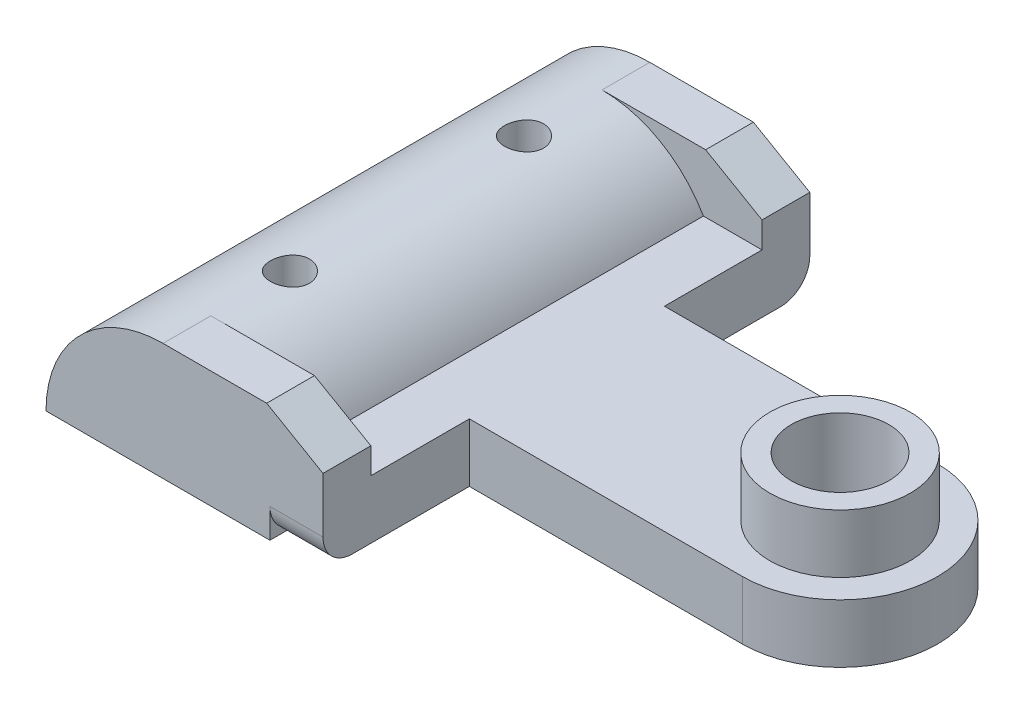
ISO-10303-21;
HEADER;
FILE_DESCRIPTION(('STEP AP214'),'2;1');
FILE_NAME('part.step','',(''),(''),'','','');
FILE_SCHEMA(('AUTOMOTIVE_DESIGN { 1 0 10303 214 1 1 1 1 }'));
ENDSEC;
DATA;
#1=APPLICATION_CONTEXT('core data for automotive mechanical design processes');
#2=APPLICATION_PROTOCOL_DEFINITION('international standard','automotive_design',2000,#1);
#3=PRODUCT_CONTEXT('',#1,'mechanical');
#4=PRODUCT('Part','Part','',(#3));
#5=PRODUCT_RELATED_PRODUCT_CATEGORY('part','',(#4));
#6=PRODUCT_DEFINITION_FORMATION('','',#4);
#7=PRODUCT_DEFINITION_CONTEXT('part definition',#1,'design');
#8=PRODUCT_DEFINITION('design','',#6,#7);
#9=PRODUCT_DEFINITION_SHAPE('','',#8);
#10=(LENGTH_UNIT() NAMED_UNIT(*) SI_UNIT(.MILLI.,.METRE.));
#11=(NAMED_UNIT(*) PLANE_ANGLE_UNIT() SI_UNIT($,.RADIAN.));
#12=(NAMED_UNIT(*) SI_UNIT($,.STERADIAN.) SOLID_ANGLE_UNIT());
#13=UNCERTAINTY_MEASURE_WITH_UNIT(LENGTH_MEASURE(1.E-05),#10,'distance_accuracy_value','');
#14=(GEOMETRIC_REPRESENTATION_CONTEXT(3) GLOBAL_UNCERTAINTY_ASSIGNED_CONTEXT((#13)) GLOBAL_UNIT_ASSIGNED_CONTEXT((#10,
#11,#12)) REPRESENTATION_CONTEXT('',''));
#15=CARTESIAN_POINT('',(0.,0.,0.));
#16=DIRECTION('',(0.,0.,1.));
#17=DIRECTION('',(1.,0.,0.));
#18=AXIS2_PLACEMENT_3D('',#15,#16,#17);
#19=CARTESIAN_POINT('',(-16.8477316832416,3.,12.1034034193238));
#20=DIRECTION('',(0.,0.,-1.));
#21=DIRECTION('',(-1.,0.,0.));
#22=AXIS2_PLACEMENT_3D('',#19,#20,#21);
#23=PLANE('',#22);
#24=CARTESIAN_POINT('',(-10.8477316832416,0.,12.1034034193238));
#25=DIRECTION('',(0.,0.,1.));
#26=DIRECTION('',(1.,0.,0.));
#27=AXIS2_PLACEMENT_3D('',#24,#25,#26);
#28=CIRCLE('',#27,6.);
#29=CARTESIAN_POINT('',(-10.8477316832416,6.,12.1034034193238));
#30=VERTEX_POINT('',#29);
#31=CARTESIAN_POINT('',(-16.8477316832416,0.,12.1034034193238));
#32=VERTEX_POINT('',#31);
#33=EDGE_CURVE('E165',#30,#32,#28,.T.);
#34=ORIENTED_EDGE('',*,*,#33,.T.);
#35=DIRECTION('',(1.,0.,0.));
#36=VECTOR('',#35,1.);
#37=CARTESIAN_POINT('',(-16.8477316832416,0.,12.1034034193238));
#38=LINE('',#37,#36);
#39=CARTESIAN_POINT('',(-5.36773092030781,0.,12.1034034193238));
#40=VERTEX_POINT('',#39);
#41=EDGE_CURVE('E169',#32,#40,#38,.T.);
#42=ORIENTED_EDGE('',*,*,#41,.T.);
#43=DIRECTION('',(0.,-1.,0.));
#44=VECTOR('',#43,1.);
#45=CARTESIAN_POINT('',(-5.36773092030781,3.,12.1034034193238));
#46=LINE('',#45,#44);
#47=CARTESIAN_POINT('',(-5.36773092030781,1.5,12.1034034193238));
#48=VERTEX_POINT('',#47);
#49=EDGE_CURVE('E399',#48,#40,#46,.T.);
#50=ORIENTED_EDGE('',*,*,#49,.F.);
#51=DIRECTION('',(1.,0.,0.));
#52=VECTOR('',#51,1.);
#53=CARTESIAN_POINT('',(-5.36773092030781,1.5,12.1034034193238));
#54=LINE('',#53,#52);
#55=CARTESIAN_POINT('',(-2.64773092030781,1.5,12.1034034193238));
#56=VERTEX_POINT('',#55);
#57=EDGE_CURVE('E409',#48,#56,#54,.T.);
#58=ORIENTED_EDGE('',*,*,#57,.T.);
#59=DIRECTION('',(0.,-1.,0.));
#60=VECTOR('',#59,1.);
#61=CARTESIAN_POINT('',(-2.64773092030781,3.,12.1034034193238));
#62=LINE('',#61,#60);
#63=CARTESIAN_POINT('',(-2.64773092030781,4.33,12.1034034193238));
#64=VERTEX_POINT('',#63);
#65=EDGE_CURVE('E241',#64,#56,#62,.T.);
#66=ORIENTED_EDGE('',*,*,#65,.F.);
#67=DIRECTION('',(0.865836232375568,-0.500327511441937,0.));
#68=VECTOR('',#67,1.);
#69=CARTESIAN_POINT('',(-5.53773092030781,6.,12.1034034193238));
#70=LINE('',#69,#68);
#71=CARTESIAN_POINT('',(-5.53773092030781,6.,12.1034034193238));
#72=VERTEX_POINT('',#71);
#73=EDGE_CURVE('E255',#72,#64,#70,.T.);
#74=ORIENTED_EDGE('',*,*,#73,.F.);
#75=DIRECTION('',(1.,0.,0.));
#76=VECTOR('',#75,1.);
#77=CARTESIAN_POINT('',(-2.64773092030781,6.,12.1034034193238));
#78=LINE('',#77,#76);
#79=EDGE_CURVE('E172',#30,#72,#78,.T.);
#80=ORIENTED_EDGE('',*,*,#79,.F.);
#81=EDGE_LOOP('',(#34,#42,#50,#58,#66,#74,#80));
#82=FACE_BOUND('',#81,.T.);
#83=ADVANCED_FACE('F39',(#82),#23,.F.);
#84=CARTESIAN_POINT('',(11.352269702831,3.,-0.396596580674838));
#85=DIRECTION('',(0.,1.,0.));
#86=DIRECTION('',(0.,0.,1.));
#87=AXIS2_PLACEMENT_3D('',#84,#85,#86);
#88=PLANE('',#87);
#89=DIRECTION('',(0.,0.,1.));
#90=VECTOR('',#89,1.);
#91=CARTESIAN_POINT('',(-5.65157926053492,3.,-23.6632502163318));
#92=LINE('',#91,#90);
#93=CARTESIAN_POINT('',(-5.65157926053492,3.,-10.3965963899398));
#94=VERTEX_POINT('',#93);
#95=CARTESIAN_POINT('',(-5.65157926053492,3.,9.6534034193238));
#96=VERTEX_POINT('',#95);
#97=EDGE_CURVE('E177',#94,#96,#92,.T.);
#98=ORIENTED_EDGE('',*,*,#97,.T.);
#99=DIRECTION('',(-1.,0.,0.));
#100=VECTOR('',#99,1.);
#101=CARTESIAN_POINT('',(-2.64773092030781,3.,9.6534034193238));
#102=LINE('',#101,#100);
#103=CARTESIAN_POINT('',(-2.64773092030781,3.,9.6534034193238));
#104=VERTEX_POINT('',#103);
#105=EDGE_CURVE('E279',#104,#96,#102,.T.);
#106=ORIENTED_EDGE('',*,*,#105,.F.);
#107=DIRECTION('',(0.,0.,-1.));
#108=VECTOR('',#107,1.);
#109=CARTESIAN_POINT('',(-2.64773092030781,3.,4.60340341932509));
#110=LINE('',#109,#108);
#111=CARTESIAN_POINT('',(-2.64773092030781,3.,4.60340341932509));
#112=VERTEX_POINT('',#111);
#113=EDGE_CURVE('E219',#104,#112,#110,.T.);
#114=ORIENTED_EDGE('',*,*,#113,.T.);
#115=DIRECTION('',(1.,0.,0.));
#116=VECTOR('',#115,1.);
#117=CARTESIAN_POINT('',(11.352269702831,3.,4.6034034193251));
#118=LINE('',#117,#116);
#119=CARTESIAN_POINT('',(11.352269702831,3.,4.6034034193251));
#120=VERTEX_POINT('',#119);
#121=EDGE_CURVE('E318',#112,#120,#118,.T.);
#122=ORIENTED_EDGE('',*,*,#121,.T.);
#123=CARTESIAN_POINT('',(11.352269702831,3.,-0.396596580674838));
#124=DIRECTION('',(0.,1.,0.));
#125=DIRECTION('',(0.,0.,1.));
#126=AXIS2_PLACEMENT_3D('',#123,#124,#125);
#127=CIRCLE('',#126,4.99999999999993);
#128=CARTESIAN_POINT('',(11.352269702831,3.,-5.39659658067477));
#129=VERTEX_POINT('',#128);
#130=EDGE_CURVE('E321',#120,#129,#127,.T.);
#131=ORIENTED_EDGE('',*,*,#130,.T.);
#132=DIRECTION('',(-1.,0.,0.));
#133=VECTOR('',#132,1.);
#134=CARTESIAN_POINT('',(11.352269702831,3.,-5.39659658067477));
#135=LINE('',#134,#133);
#136=CARTESIAN_POINT('',(-2.64773092030781,3.,-5.39659658067477));
#137=VERTEX_POINT('',#136);
#138=EDGE_CURVE('E324',#129,#137,#135,.T.);
#139=ORIENTED_EDGE('',*,*,#138,.T.);
#140=DIRECTION('',(0.,0.,-1.));
#141=VECTOR('',#140,1.);
#142=CARTESIAN_POINT('',(-2.64773092030781,3.,-12.8465963899398));
#143=LINE('',#142,#141);
#144=CARTESIAN_POINT('',(-2.64773092030781,3.,-10.3965963899398));
#145=VERTEX_POINT('',#144);
#146=EDGE_CURVE('E225',#137,#145,#143,.T.);
#147=ORIENTED_EDGE('',*,*,#146,.T.);
#148=DIRECTION('',(1.,0.,0.));
#149=VECTOR('',#148,1.);
#150=CARTESIAN_POINT('',(-2.64773092030781,3.,-10.3965963899398));
#151=LINE('',#150,#149);
#152=EDGE_CURVE('E273',#94,#145,#151,.T.);
#153=ORIENTED_EDGE('',*,*,#152,.F.);
#154=EDGE_LOOP('',(#98,#106,#114,#122,#131,#139,#147,#153));
#155=FACE_BOUND('',#154,.T.);
#156=CARTESIAN_POINT('',(11.3522690891547,3.,-0.396596520126448));
#157=DIRECTION('',(0.,1.,0.));
#158=DIRECTION('',(0.,0.,1.));
#159=AXIS2_PLACEMENT_3D('',#156,#157,#158);
#160=CIRCLE('',#159,3.6);
#161=CARTESIAN_POINT('',(11.3522690891547,3.,3.20340347987355));
#162=VERTEX_POINT('',#161);
#163=EDGE_CURVE('E422',#162,#162,#160,.T.);
#164=ORIENTED_EDGE('',*,*,#163,.F.);
#165=EDGE_LOOP('',(#164));
#166=FACE_BOUND('',#165,.T.);
#167=ADVANCED_FACE('F331',(#155,#166),#88,.T.);
#168=CARTESIAN_POINT('',(-10.8477316832416,0.,-23.6632502163318));
#169=DIRECTION('',(0.,0.,1.));
#170=DIRECTION('',(1.,0.,0.));
#171=AXIS2_PLACEMENT_3D('',#168,#169,#170);
#172=CYLINDRICAL_SURFACE('',#171,6.);
#173=CARTESIAN_POINT('',(-10.8477314940143,6.,-7.39659658067497));
#174=CARTESIAN_POINT('',(-10.9034878583811,5.9999990464337,-7.39659434509584));
#175=CARTESIAN_POINT('',(-10.9592746515408,5.99921471510292,-7.39191767050584));
#176=CARTESIAN_POINT('',(-11.06928359227,5.99616138642469,-7.37334231624371));
#177=CARTESIAN_POINT('',(-11.1235042531726,5.99389102387063,-7.35943515642365));
#178=CARTESIAN_POINT('',(-11.2287734095585,5.98812028394675,-7.32283039824837));
#179=CARTESIAN_POINT('',(-11.2798244603423,5.9846209129477,-7.30013999048727));
#180=CARTESIAN_POINT('',(-11.3773882541802,5.97677692304326,-7.2466316576828));
#181=CARTESIAN_POINT('',(-11.4239015154637,5.97243240082681,-7.21581466221271));
#182=CARTESIAN_POINT('',(-11.511520569201,5.9633332876299,-7.14661453679763));
#183=CARTESIAN_POINT('',(-11.5525766867519,5.95857550594815,-7.1081689228952));
#184=CARTESIAN_POINT('',(-11.6276869282337,5.94921052776879,-7.02493737795738));
#185=CARTESIAN_POINT('',(-11.6617406101041,5.94460334079357,-6.98015104693681));
#186=CARTESIAN_POINT('',(-11.7220783835222,5.93603028513497,-6.88516817306038));
#187=CARTESIAN_POINT('',(-11.7483133557575,5.93206853893468,-6.83494002265029));
#188=CARTESIAN_POINT('',(-11.7919548830719,5.9252791825018,-6.73071272715132));
#189=CARTESIAN_POINT('',(-11.8093620344949,5.92245149566304,-6.67671383706681));
#190=CARTESIAN_POINT('',(-11.8346972905648,5.91828217135205,-6.56700443560904));
#191=CARTESIAN_POINT('',(-11.8427111516911,5.91692709802402,-6.51131424829051));
#192=CARTESIAN_POINT('',(-11.849298230857,5.91581577987258,-6.39936442675891));
#193=CARTESIAN_POINT('',(-11.8478721170147,5.91605942189945,-6.3431048331272));
#194=CARTESIAN_POINT('',(-11.8356895799674,5.91810573926517,-6.23222538476013));
#195=CARTESIAN_POINT('',(-11.8250294929802,5.9198923168875,-6.17759460504887));
#196=CARTESIAN_POINT('',(-11.7948327951151,5.92479800391048,-6.07090799382932));
#197=CARTESIAN_POINT('',(-11.7752958797957,5.92791715901325,-6.01885225070289));
#198=CARTESIAN_POINT('',(-11.727802434273,5.93515393919809,-5.9185049837081));
#199=CARTESIAN_POINT('',(-11.699805900048,5.93927628977689,-5.87023274817706));
#200=CARTESIAN_POINT('',(-11.6362163384054,5.9480516937986,-5.77903474570732));
#201=CARTESIAN_POINT('',(-11.6006226978699,5.95270479006076,-5.73610941072866));
#202=CARTESIAN_POINT('',(-11.5223244106596,5.96208812934517,-5.65626606542812));
#203=CARTESIAN_POINT('',(-11.479537109327,5.96681861382743,-5.61942909056768));
#204=CARTESIAN_POINT('',(-11.3883456190559,5.97577042041917,-5.55344538975228));
#205=CARTESIAN_POINT('',(-11.3399413939297,5.97999173924794,-5.52429871334699));
#206=CARTESIAN_POINT('',(-11.2388138790208,5.98745558273837,-5.47451560027352));
#207=CARTESIAN_POINT('',(-11.1860870004779,5.99069728342084,-5.45388632247191));
#208=CARTESIAN_POINT('',(-11.0778508438011,5.99583001889056,-5.42179880263766));
#209=CARTESIAN_POINT('',(-11.0223417988418,5.99772116666637,-5.41033979340175));
#210=CARTESIAN_POINT('',(-10.9108154589367,5.99992452133552,-5.39702794409909));
#211=CARTESIAN_POINT('',(-10.8548117909129,6.00025501229387,-5.39506385859247));
#212=CARTESIAN_POINT('',(-10.7432755822185,5.99934989436594,-5.40050102509316));
#213=CARTESIAN_POINT('',(-10.6877430235032,5.99811434573826,-5.40790191675162));
#214=CARTESIAN_POINT('',(-10.5790690141092,5.99422729886033,-5.43176642794667));
#215=CARTESIAN_POINT('',(-10.5259151345633,5.99158440841287,-5.44817497213957));
#216=CARTESIAN_POINT('',(-10.4231127233009,5.98517784322812,-5.48953029755892));
#217=CARTESIAN_POINT('',(-10.3734643886194,5.98141410555369,-5.51447755825803));
#218=CARTESIAN_POINT('',(-10.2785991946117,5.97313804495016,-5.57245694340655));
#219=CARTESIAN_POINT('',(-10.2334253677268,5.96861940142191,-5.60555855743374));
#220=CARTESIAN_POINT('',(-10.1492340295825,5.95935384386154,-5.67881142437696));
#221=CARTESIAN_POINT('',(-10.1102169658845,5.95460691326696,-5.71896318935081));
#222=CARTESIAN_POINT('',(-10.0390343461339,5.94536067031806,-5.80567552331143));
#223=CARTESIAN_POINT('',(-10.0069439518167,5.94086443243297,-5.85229817252369));
#224=CARTESIAN_POINT('',(-9.95105052908947,5.93268608435176,-5.95033769875521));
#225=CARTESIAN_POINT('',(-9.92724723797941,5.92900394835007,-6.00175442373745));
#226=CARTESIAN_POINT('',(-9.88871611722565,5.92289377699887,-6.10771241185236));
#227=CARTESIAN_POINT('',(-9.87395087600144,5.92046057872135,-6.16223975925825));
#228=CARTESIAN_POINT('',(-9.85379726635701,5.91711082780508,-6.27304457809401));
#229=CARTESIAN_POINT('',(-9.84840808273143,5.91619414331273,-6.32932189693875));
#230=CARTESIAN_POINT('',(-9.84718230083408,5.91598689242416,-6.44127860038113));
#231=CARTESIAN_POINT('',(-9.85122739284518,5.91667618628423,-6.49695668773503));
#232=CARTESIAN_POINT('',(-9.86849951212635,5.91955908685278,-6.60682824009526));
#233=CARTESIAN_POINT('',(-9.88172650963563,5.92175268868544,-6.661021709913));
#234=CARTESIAN_POINT('',(-9.9169416532798,5.92738938836382,-6.76633992243615));
#235=CARTESIAN_POINT('',(-9.93891961353757,5.93083103310807,-6.81746815366499));
#236=CARTESIAN_POINT('',(-9.99100064979604,5.93857744224092,-6.91533082143178));
#237=CARTESIAN_POINT('',(-10.0211041287879,5.942882249436,-6.96206503989035));
#238=CARTESIAN_POINT('',(-10.0890039008163,5.95193378703998,-7.05041079305472));
#239=CARTESIAN_POINT('',(-10.1268872305216,5.95668515481279,-7.09195496854283));
#240=CARTESIAN_POINT('',(-10.2090878464892,5.96605746545558,-7.16813720750937));
#241=CARTESIAN_POINT('',(-10.2534066155648,5.97067837797299,-7.20277367497997));
#242=CARTESIAN_POINT('',(-10.3475837967921,5.97930610030225,-7.26437587831846));
#243=CARTESIAN_POINT('',(-10.3974783518953,5.98330844875507,-7.29128698842716));
#244=CARTESIAN_POINT('',(-10.5011262439666,5.99020465818984,-7.33630436945605));
#245=CARTESIAN_POINT('',(-10.5548756763356,5.99309962252339,-7.35441940929062));
#246=CARTESIAN_POINT('',(-10.6486501556404,5.99682315659141,-7.37739868844218));
#247=CARTESIAN_POINT('',(-10.6881079503483,5.99800810376942,-7.38458636734036));
#248=CARTESIAN_POINT('',(-10.7676157640569,5.9995968613589,-7.39418607557361));
#249=CARTESIAN_POINT('',(-10.8076657728495,6.00000068521902,-7.39659818712997));
#250=CARTESIAN_POINT('',(-10.8477314940143,6.,-7.39659658067497));
#251=B_SPLINE_CURVE_WITH_KNOTS('',3,(#173,#174,#175,#176,#177,#178,#179,#180,#181,#182,#183,
#184,#185,#186,#187,#188,#189,#190,#191,#192,#193,#194,#195,#196,#197,#198,#199,#200,#201,#202,
#203,#204,#205,#206,#207,#208,#209,#210,#211,#212,#213,#214,#215,#216,#217,#218,#219,#220,#221,
#222,#223,#224,#225,#226,#227,#228,#229,#230,#231,#232,#233,#234,#235,#236,#237,#238,#239,#240,
#241,#242,#243,#244,#245,#246,#247,#248,#249,#250),.UNSPECIFIED.,.T.,.F.,(4,2,2,2,2,2,2,2,2,2,2,
2,2,2,2,2,2,2,2,2,2,2,2,2,2,2,2,2,2,2,2,2,2,2,2,2,2,2,4),(0.,0.167122641115988,
0.334399032551409,0.501538768229684,0.668659393637694,0.837209999826244,1.00577124326703,
1.17537013334848,1.34495756502753,1.51298437404163,1.68099929101878,1.84728216918787,
2.01357075065858,2.18065832534667,2.34775938979574,2.51693119446551,2.68610408910605,
2.85541888538372,3.02471951496076,3.19203167788578,3.35933740311112,3.52563138663997,
3.69193470957041,3.85970747727199,4.02749243548172,4.19701548004996,4.36653315027314,
4.5353442980931,4.70414076782159,4.87083186165462,5.0375224152041,5.20401951013615,
5.37052486413315,5.53900578851508,5.70752559498964,5.87720919460256,6.04672328539223,
6.16681727828283,6.28690920348843),.UNSPECIFIED.);
#252=CARTESIAN_POINT('',(-10.8477314940143,6.,-7.39659658067497));
#253=VERTEX_POINT('',#252);
#254=EDGE_CURVE('E442',#253,#253,#251,.T.);
#255=ORIENTED_EDGE('',*,*,#254,.F.);
#256=EDGE_LOOP('',(#255));
#257=FACE_BOUND('',#256,.T.);
#258=CARTESIAN_POINT('',(-10.8477308160423,5.99999999999994,4.6034034193251));
#259=CARTESIAN_POINT('',(-10.9034871849603,5.99999905273383,4.60340565490416));
#260=CARTESIAN_POINT('',(-10.9592739827565,5.9992147275788,4.60808232981505));
#261=CARTESIAN_POINT('',(-11.0692829328047,5.99616141083237,4.62665768543437));
#262=CARTESIAN_POINT('',(-11.1235035983904,5.99389105403437,4.64056484628892));
#263=CARTESIAN_POINT('',(-11.2287727640442,5.98812032506091,4.67716960728137));
#264=CARTESIAN_POINT('',(-11.2798238194115,5.98462095925609,4.69986001682866));
#265=CARTESIAN_POINT('',(-11.3773876221148,5.97677697908934,4.75336835391635));
#266=CARTESIAN_POINT('',(-11.4239008876802,5.97243246141637,4.78418535188371));
#267=CARTESIAN_POINT('',(-11.5115199493164,5.96333335665549,4.85338548274453));
#268=CARTESIAN_POINT('',(-11.5525760705125,5.95857557886223,4.89183109956046));
#269=CARTESIAN_POINT('',(-11.6276863187911,5.94921060768682,4.97506265076197));
#270=CARTESIAN_POINT('',(-11.6617400038131,5.94460342382703,5.01984898513287));
#271=CARTESIAN_POINT('',(-11.7220777832524,5.93603037356567,5.11483186643039));
#272=CARTESIAN_POINT('',(-11.7483127582915,5.93206862964741,5.16506002095346));
#273=CARTESIAN_POINT('',(-11.7919542905284,5.92527927693459,5.26928732497848));
#274=CARTESIAN_POINT('',(-11.809361444069,5.92245159153406,5.32328621947644));
#275=CARTESIAN_POINT('',(-11.8346967038735,5.91828226919581,5.43299563083147));
#276=CARTESIAN_POINT('',(-11.8427105664731,5.91692719643369,5.48868582366738));
#277=CARTESIAN_POINT('',(-11.8492976475874,5.91581587862248,5.60063565638838));
#278=CARTESIAN_POINT('',(-11.8478715342196,5.91605952042384,5.65689525569215));
#279=CARTESIAN_POINT('',(-11.835688997042,5.91810583657768,5.76777471591701));
#280=CARTESIAN_POINT('',(-11.8250289093691,5.91989241323686,5.8224055018034));
#281=CARTESIAN_POINT('',(-11.7948322089458,5.92479809761449,5.92909212518596));
#282=CARTESIAN_POINT('',(-11.775295291754,5.927917251035,5.98114787430029));
#283=CARTESIAN_POINT('',(-11.727801841427,5.93515402711399,6.08149515265952));
#284=CARTESIAN_POINT('',(-11.6998053043048,5.93927637526103,6.12976739358447));
#285=CARTESIAN_POINT('',(-11.6362157358407,5.94805177369175,6.22096540626019));
#286=CARTESIAN_POINT('',(-11.6006220913814,5.95270486679457,6.26389074605127));
#287=CARTESIAN_POINT('',(-11.5223237959542,5.9620881989197,6.34373409963799));
#288=CARTESIAN_POINT('',(-11.479536490418,5.96681867939264,6.38057107806069));
#289=CARTESIAN_POINT('',(-11.3883449911733,5.97577047725304,6.4465547852208));
#290=CARTESIAN_POINT('',(-11.3399407612778,5.97999179135982,6.47570146440927));
#291=CARTESIAN_POINT('',(-11.2388132371092,5.98745562469925,6.52548458184614));
#292=CARTESIAN_POINT('',(-11.18608635413,5.99069731996467,6.54611386133592));
#293=CARTESIAN_POINT('',(-11.0778501884985,5.99583004407889,6.57820138385782));
#294=CARTESIAN_POINT('',(-11.0223411390209,5.99772118591631,6.58966039409332));
#295=CARTESIAN_POINT('',(-10.9108147901412,5.99992452840767,6.60297224474778));
#296=CARTESIAN_POINT('',(-10.8548111176589,6.00025501312934,6.60493633060407));
#297=CARTESIAN_POINT('',(-10.7432749002089,5.99934988253253,6.59949916423093));
#298=CARTESIAN_POINT('',(-10.6877423371965,5.99811432747253,6.59209827234955));
#299=CARTESIAN_POINT('',(-10.5790683186307,5.99422726773577,6.56823376004424));
#300=CARTESIAN_POINT('',(-10.5259144342393,5.99158437084099,6.5518252148336));
#301=CARTESIAN_POINT('',(-10.4231120135913,5.98517779292147,6.51046988670153));
#302=CARTESIAN_POINT('',(-10.3734636743702,5.98141404895948,6.4855226243066));
#303=CARTESIAN_POINT('',(-10.2785984708393,5.973137976033,6.42754323466036));
#304=CARTESIAN_POINT('',(-10.23342463905,5.96861932646143,6.39444161770243));
#305=CARTESIAN_POINT('',(-10.1492332916777,5.95935375740858,6.3211887440548));
#306=CARTESIAN_POINT('',(-10.1102162236563,5.95460682136488,6.28103697530692));
#307=CARTESIAN_POINT('',(-10.0390335958437,5.94536056829096,6.19432463287911));
#308=CARTESIAN_POINT('',(-10.0069431978093,5.94086432573926,6.14770197895358));
#309=CARTESIAN_POINT('',(-9.95104976854576,5.93268596941955,6.04966244256571));
#310=CARTESIAN_POINT('',(-9.92724647461572,5.92900382984587,5.99824571214087));
#311=CARTESIAN_POINT('',(-9.88871534959159,5.92289365271397,5.89228771343161));
#312=CARTESIAN_POINT('',(-9.87395010677324,5.9204604522031,5.83776036092813));
#313=CARTESIAN_POINT('',(-9.8537964948231,5.9171106982081,5.72695553162473));
#314=CARTESIAN_POINT('',(-9.84840731048464,5.91619401287006,5.67067820741021));
#315=CARTESIAN_POINT('',(-9.84718152810495,5.9159867617352,5.5587214942968));
#316=CARTESIAN_POINT('',(-9.85122662016024,5.91667605614704,5.50304340264413));
#317=CARTESIAN_POINT('',(-9.86849874006663,5.91955895913691,5.39317184177872));
#318=CARTESIAN_POINT('',(-9.88172573815679,5.92175256283908,5.33897836775455));
#319=CARTESIAN_POINT('',(-9.916940883407,5.92738926747252,5.23366014711104));
#320=CARTESIAN_POINT('',(-9.93891884467349,5.93083091529862,5.1825319119626));
#321=CARTESIAN_POINT('',(-9.99099988333006,5.93857733167398,5.08466923656718));
#322=CARTESIAN_POINT('',(-10.021103363712,5.94288214302982,5.03793501439996));
#323=CARTESIAN_POINT('',(-10.0890031394534,5.95193369000049,4.94958925323561));
#324=CARTESIAN_POINT('',(-10.1268864716099,5.95668506299675,4.90804507355456));
#325=CARTESIAN_POINT('',(-10.2090870930447,5.9660573848254,4.83186282661854));
#326=CARTESIAN_POINT('',(-10.253405865137,5.97067830330538,4.7972263553722));
#327=CARTESIAN_POINT('',(-10.3475830538487,5.97930603819519,4.73562414434452));
#328=CARTESIAN_POINT('',(-10.3974776135198,5.98330839323769,4.70871303047103));
#329=CARTESIAN_POINT('',(-10.5011255154282,5.99020461608138,4.66369564277704));
#330=CARTESIAN_POINT('',(-10.5548749530662,5.99309958723383,4.64558060004229));
#331=CARTESIAN_POINT('',(-10.6486494442322,5.9968231330163,4.62260131622208));
#332=CARTESIAN_POINT('',(-10.6881072454516,5.99800808505485,4.6154136355869));
#333=CARTESIAN_POINT('',(-10.7676150724605,5.99959685216826,4.60581392502157));
#334=CARTESIAN_POINT('',(-10.8076650880419,6.0000006806918,4.60340181287001));
#335=CARTESIAN_POINT('',(-10.8477308160423,5.99999999999994,4.6034034193251));
#336=B_SPLINE_CURVE_WITH_KNOTS('',3,(#258,#259,#260,#261,#262,#263,#264,#265,#266,#267,#268,
#269,#270,#271,#272,#273,#274,#275,#276,#277,#278,#279,#280,#281,#282,#283,#284,#285,#286,#287,
#288,#289,#290,#291,#292,#293,#294,#295,#296,#297,#298,#299,#300,#301,#302,#303,#304,#305,#306,
#307,#308,#309,#310,#311,#312,#313,#314,#315,#316,#317,#318,#319,#320,#321,#322,#323,#324,#325,
#326,#327,#328,#329,#330,#331,#332,#333,#334,#335),.UNSPECIFIED.,.T.,.F.,(4,2,2,2,2,2,2,2,2,2,2,
2,2,2,2,2,2,2,2,2,2,2,2,2,2,2,2,2,2,2,2,2,2,2,2,2,2,2,4),(0.,0.167122654747227,
0.334399059781409,0.501538809125076,0.668659448203429,0.837210067262265,1.00577132357735,
1.1753702279275,1.34495767389273,1.51298449980563,1.68099943369189,1.84728233024387,
2.01357093009567,2.1806585224559,2.34775960456564,2.51693142461402,2.68610433461736,
2.85541914411729,3.02471978691467,3.19203196308608,3.35933770157164,3.52563170073785,
3.69193503932254,3.85970782541018,4.02749280201372,4.19701586549662,4.36653355461743,
4.53534471861892,4.70414120450532,4.87083231116394,5.03752287753591,5.20401998497387,
5.3705253514916,5.53900629134196,5.7075261133057,5.87720973160492,6.04672384108161,
6.16681785445653,6.28690980014354),.UNSPECIFIED.);
#337=CARTESIAN_POINT('',(-10.8477308160423,5.99999999999994,4.6034034193251));
#338=VERTEX_POINT('',#337);
#339=EDGE_CURVE('E433',#338,#338,#336,.T.);
#340=ORIENTED_EDGE('',*,*,#339,.F.);
#341=EDGE_LOOP('',(#340));
#342=FACE_BOUND('',#341,.T.);
#343=DIRECTION('',(0.,0.,1.));
#344=VECTOR('',#343,1.);
#345=CARTESIAN_POINT('',(-10.8477316832416,6.,-12.8465963899398));
#346=LINE('',#345,#344);
#347=CARTESIAN_POINT('',(-10.8477316832416,6.,-12.8465963899398));
#348=VERTEX_POINT('',#347);
#349=CARTESIAN_POINT('',(-10.8477316832416,6.,-10.3965963899398));
#350=VERTEX_POINT('',#349);
#351=EDGE_CURVE('E288',#348,#350,#346,.T.);
#352=ORIENTED_EDGE('',*,*,#351,.F.);
#353=CARTESIAN_POINT('',(-10.8477316832416,0.,-12.8465963899398));
#354=DIRECTION('',(0.,0.,1.));
#355=DIRECTION('',(1.,0.,0.));
#356=AXIS2_PLACEMENT_3D('',#353,#354,#355);
#357=CIRCLE('',#356,6.);
#358=CARTESIAN_POINT('',(-16.8477316832416,0.,-12.8465963899398));
#359=VERTEX_POINT('',#358);
#360=EDGE_CURVE('E184',#359,#348,#357,.F.);
#361=ORIENTED_EDGE('',*,*,#360,.F.);
#362=DIRECTION('',(0.,0.,1.));
#363=VECTOR('',#362,1.);
#364=CARTESIAN_POINT('',(-16.8477316832416,0.,-12.8465963899398));
#365=LINE('',#364,#363);
#366=EDGE_CURVE('E181',#359,#32,#365,.T.);
#367=ORIENTED_EDGE('',*,*,#366,.T.);
#368=ORIENTED_EDGE('',*,*,#33,.F.);
#369=DIRECTION('',(0.,0.,1.));
#370=VECTOR('',#369,1.);
#371=CARTESIAN_POINT('',(-10.8477316832416,6.,12.1034034193238));
#372=LINE('',#371,#370);
#373=CARTESIAN_POINT('',(-10.8477316832416,6.,9.6534034193238));
#374=VERTEX_POINT('',#373);
#375=EDGE_CURVE('E267',#374,#30,#372,.T.);
#376=ORIENTED_EDGE('',*,*,#375,.F.);
#377=CARTESIAN_POINT('',(-10.8477316832416,0.,9.6534034193238));
#378=DIRECTION('',(0.,0.,1.));
#379=DIRECTION('',(1.,0.,0.));
#380=AXIS2_PLACEMENT_3D('',#377,#378,#379);
#381=CIRCLE('',#380,6.);
#382=EDGE_CURVE('E249',#374,#96,#381,.F.);
#383=ORIENTED_EDGE('',*,*,#382,.T.);
#384=ORIENTED_EDGE('',*,*,#97,.F.);
#385=CARTESIAN_POINT('',(-10.8477316832416,0.,-10.3965963899398));
#386=DIRECTION('',(0.,0.,-1.));
#387=DIRECTION('',(-1.,0.,0.));
#388=AXIS2_PLACEMENT_3D('',#385,#386,#387);
#389=CIRCLE('',#388,6.);
#390=EDGE_CURVE('E245',#94,#350,#389,.F.);
#391=ORIENTED_EDGE('',*,*,#390,.T.);
#392=EDGE_LOOP('',(#352,#361,#367,#368,#376,#383,#384,#391));
#393=FACE_BOUND('',#392,.T.);
#394=ADVANCED_FACE('F183',(#257,#342,#393),#172,.T.);
#395=CARTESIAN_POINT('',(11.352269702831,0.,-0.396596580674838));
#396=DIRECTION('',(0.,1.,0.));
#397=DIRECTION('',(0.,0.,1.));
#398=AXIS2_PLACEMENT_3D('',#395,#396,#397);
#399=PLANE('',#398);
#400=DIRECTION('',(1.,0.,0.));
#401=VECTOR('',#400,1.);
#402=CARTESIAN_POINT('',(11.352269702831,0.,4.6034034193251));
#403=LINE('',#402,#401);
#404=CARTESIAN_POINT('',(-2.64773092030781,0.,4.60340341932509));
#405=VERTEX_POINT('',#404);
#406=CARTESIAN_POINT('',(11.352269702831,0.,4.6034034193251));
#407=VERTEX_POINT('',#406);
#408=EDGE_CURVE('E200',#405,#407,#403,.T.);
#409=ORIENTED_EDGE('',*,*,#408,.F.);
#410=DIRECTION('',(0.,0.,-1.));
#411=VECTOR('',#410,1.);
#412=CARTESIAN_POINT('',(-2.64773092030781,0.,4.60340341932509));
#413=LINE('',#412,#411);
#414=CARTESIAN_POINT('',(-2.64773092030781,0.,10.6034034193238));
#415=VERTEX_POINT('',#414);
#416=EDGE_CURVE('E197',#415,#405,#413,.T.);
#417=ORIENTED_EDGE('',*,*,#416,.F.);
#418=DIRECTION('',(1.,0.,0.));
#419=VECTOR('',#418,1.);
#420=CARTESIAN_POINT('',(-5.36773092030781,0.,10.6034034193238));
#421=LINE('',#420,#419);
#422=CARTESIAN_POINT('',(-5.36773092030781,0.,10.6034034193238));
#423=VERTEX_POINT('',#422);
#424=EDGE_CURVE('E54',#423,#415,#421,.T.);
#425=ORIENTED_EDGE('',*,*,#424,.F.);
#426=DIRECTION('',(0.,0.,-1.));
#427=VECTOR('',#426,1.);
#428=CARTESIAN_POINT('',(-5.36773092030781,0.,-0.396596580674838));
#429=LINE('',#428,#427);
#430=EDGE_CURVE('E195',#40,#423,#429,.T.);
#431=ORIENTED_EDGE('',*,*,#430,.F.);
#432=ORIENTED_EDGE('',*,*,#41,.F.);
#433=ORIENTED_EDGE('',*,*,#366,.F.);
#434=DIRECTION('',(-1.,0.,0.));
#435=VECTOR('',#434,1.);
#436=CARTESIAN_POINT('',(-16.8477316832416,0.,-12.8465963899398));
#437=LINE('',#436,#435);
#438=CARTESIAN_POINT('',(-5.36773092030781,0.,-12.8465963899398));
#439=VERTEX_POINT('',#438);
#440=EDGE_CURVE('E216',#439,#359,#437,.T.);
#441=ORIENTED_EDGE('',*,*,#440,.F.);
#442=CARTESIAN_POINT('',(-5.36773092030781,0.,-11.3465963899398));
#443=VERTEX_POINT('',#442);
#444=EDGE_CURVE('E61',#443,#439,#429,.T.);
#445=ORIENTED_EDGE('',*,*,#444,.F.);
#446=DIRECTION('',(1.,0.,0.));
#447=VECTOR('',#446,1.);
#448=CARTESIAN_POINT('',(-5.36773092030781,0.,-11.3465963899398));
#449=LINE('',#448,#447);
#450=CARTESIAN_POINT('',(-2.64773092030781,0.,-11.3465963899398));
#451=VERTEX_POINT('',#450);
#452=EDGE_CURVE('E369',#443,#451,#449,.T.);
#453=ORIENTED_EDGE('',*,*,#452,.T.);
#454=DIRECTION('',(0.,0.,-1.));
#455=VECTOR('',#454,1.);
#456=CARTESIAN_POINT('',(-2.64773092030781,0.,-12.8465963899398));
#457=LINE('',#456,#455);
#458=CARTESIAN_POINT('',(-2.64773092030781,0.,-5.39659658067477));
#459=VERTEX_POINT('',#458);
#460=EDGE_CURVE('E212',#459,#451,#457,.T.);
#461=ORIENTED_EDGE('',*,*,#460,.F.);
#462=DIRECTION('',(-1.,0.,0.));
#463=VECTOR('',#462,1.);
#464=CARTESIAN_POINT('',(11.352269702831,0.,-5.39659658067477));
#465=LINE('',#464,#463);
#466=CARTESIAN_POINT('',(11.352269702831,0.,-5.39659658067477));
#467=VERTEX_POINT('',#466);
#468=EDGE_CURVE('E209',#467,#459,#465,.T.);
#469=ORIENTED_EDGE('',*,*,#468,.F.);
#470=CARTESIAN_POINT('',(11.352269702831,0.,-0.396596580674838));
#471=DIRECTION('',(0.,1.,0.));
#472=DIRECTION('',(0.,0.,1.));
#473=AXIS2_PLACEMENT_3D('',#470,#471,#472);
#474=CIRCLE('',#473,4.99999999999993);
#475=EDGE_CURVE('E206',#407,#467,#474,.T.);
#476=ORIENTED_EDGE('',*,*,#475,.F.);
#477=EDGE_LOOP('',(#409,#417,#425,#431,#432,#433,#441,#445,#453,#461,#469,#476));
#478=FACE_BOUND('',#477,.T.);
#479=CARTESIAN_POINT('',(11.3522690891547,0.,-0.396596520126448));
#480=DIRECTION('',(0.,1.,0.));
#481=DIRECTION('',(0.,0.,1.));
#482=AXIS2_PLACEMENT_3D('',#479,#480,#481);
#483=CIRCLE('',#482,2.50000026589674);
#484=CARTESIAN_POINT('',(11.3522690891547,0.,2.10340374577029));
#485=VERTEX_POINT('',#484);
#486=EDGE_CURVE('E189',#485,#485,#483,.T.);
#487=ORIENTED_EDGE('',*,*,#486,.T.);
#488=EDGE_LOOP('',(#487));
#489=FACE_BOUND('',#488,.T.);
#490=CARTESIAN_POINT('',(-10.8477314940143,0.,-6.39659653401701));
#491=DIRECTION('',(0.,1.,0.));
#492=DIRECTION('',(0.,0.,1.));
#493=AXIS2_PLACEMENT_3D('',#490,#491,#492);
#494=CIRCLE('',#493,1.00000004665796);
#495=CARTESIAN_POINT('',(-10.8477314940143,0.,-5.39659648735905));
#496=VERTEX_POINT('',#495);
#497=EDGE_CURVE('E309',#496,#496,#494,.T.);
#498=ORIENTED_EDGE('',*,*,#497,.T.);
#499=EDGE_LOOP('',(#498));
#500=FACE_BOUND('',#499,.T.);
#501=CARTESIAN_POINT('',(-10.8477308160423,0.,5.60340356054875));
#502=DIRECTION('',(0.,1.,0.));
#503=DIRECTION('',(0.,0.,1.));
#504=AXIS2_PLACEMENT_3D('',#501,#502,#503);
#505=CIRCLE('',#504,1.00000014122365);
#506=CARTESIAN_POINT('',(-10.8477308160423,0.,6.6034037017724));
#507=VERTEX_POINT('',#506);
#508=EDGE_CURVE('E301',#507,#507,#505,.T.);
#509=ORIENTED_EDGE('',*,*,#508,.T.);
#510=EDGE_LOOP('',(#509));
#511=FACE_BOUND('',#510,.T.);
#512=ADVANCED_FACE('F193',(#478,#489,#500,#511),#399,.F.);
#513=CARTESIAN_POINT('',(-2.64773092030781,3.,4.60340341932509));
#514=DIRECTION('',(-1.,0.,0.));
#515=DIRECTION('',(0.,0.,1.));
#516=AXIS2_PLACEMENT_3D('',#513,#514,#515);
#517=PLANE('',#516);
#518=ORIENTED_EDGE('',*,*,#65,.T.);
#519=CARTESIAN_POINT('',(-2.64773092030781,1.5,10.6034034193238));
#520=DIRECTION('',(-1.,0.,0.));
#521=DIRECTION('',(0.,0.,-1.));
#522=AXIS2_PLACEMENT_3D('',#519,#520,#521);
#523=CIRCLE('',#522,1.5);
#524=EDGE_CURVE('E374',#415,#56,#523,.T.);
#525=ORIENTED_EDGE('',*,*,#524,.F.);
#526=ORIENTED_EDGE('',*,*,#416,.T.);
#527=DIRECTION('',(0.,-1.,0.));
#528=VECTOR('',#527,1.);
#529=CARTESIAN_POINT('',(-2.64773092030781,3.,4.60340341932509));
#530=LINE('',#529,#528);
#531=EDGE_CURVE('E237',#112,#405,#530,.T.);
#532=ORIENTED_EDGE('',*,*,#531,.F.);
#533=ORIENTED_EDGE('',*,*,#113,.F.);
#534=DIRECTION('',(0.,-1.,0.));
#535=VECTOR('',#534,1.);
#536=CARTESIAN_POINT('',(-2.64773092030781,6.,9.6534034193238));
#537=LINE('',#536,#535);
#538=CARTESIAN_POINT('',(-2.64773092030781,4.33,9.6534034193238));
#539=VERTEX_POINT('',#538);
#540=EDGE_CURVE('E269',#539,#104,#537,.T.);
#541=ORIENTED_EDGE('',*,*,#540,.F.);
#542=DIRECTION('',(0.,0.,1.));
#543=VECTOR('',#542,1.);
#544=CARTESIAN_POINT('',(-2.64773092030781,4.33,-18.8965965806762));
#545=LINE('',#544,#543);
#546=EDGE_CURVE('E264',#539,#64,#545,.T.);
#547=ORIENTED_EDGE('',*,*,#546,.T.);
#548=EDGE_LOOP('',(#518,#525,#526,#532,#533,#541,#547));
#549=FACE_BOUND('',#548,.T.);
#550=ADVANCED_FACE('F355',(#549),#517,.F.);
#551=CARTESIAN_POINT('',(11.352269702831,3.,4.6034034193251));
#552=DIRECTION('',(0.,0.,-1.));
#553=DIRECTION('',(-1.,0.,0.));
#554=AXIS2_PLACEMENT_3D('',#551,#552,#553);
#555=PLANE('',#554);
#556=ORIENTED_EDGE('',*,*,#408,.T.);
#557=DIRECTION('',(0.,-1.,0.));
#558=VECTOR('',#557,1.);
#559=CARTESIAN_POINT('',(11.352269702831,3.,4.6034034193251));
#560=LINE('',#559,#558);
#561=EDGE_CURVE('E233',#120,#407,#560,.T.);
#562=ORIENTED_EDGE('',*,*,#561,.F.);
#563=ORIENTED_EDGE('',*,*,#121,.F.);
#564=ORIENTED_EDGE('',*,*,#531,.T.);
#565=EDGE_LOOP('',(#556,#562,#563,#564));
#566=FACE_BOUND('',#565,.T.);
#567=ADVANCED_FACE('F361',(#566),#555,.F.);
#568=CARTESIAN_POINT('',(11.352269702831,3.,-0.396596580674838));
#569=DIRECTION('',(0.,-1.,0.));
#570=DIRECTION('',(0.,0.,-1.));
#571=AXIS2_PLACEMENT_3D('',#568,#569,#570);
#572=CYLINDRICAL_SURFACE('',#571,4.99999999999993);
#573=ORIENTED_EDGE('',*,*,#475,.T.);
#574=DIRECTION('',(0.,-1.,0.));
#575=VECTOR('',#574,1.);
#576=CARTESIAN_POINT('',(11.352269702831,3.,-5.39659658067477));
#577=LINE('',#576,#575);
#578=EDGE_CURVE('E229',#129,#467,#577,.T.);
#579=ORIENTED_EDGE('',*,*,#578,.F.);
#580=ORIENTED_EDGE('',*,*,#130,.F.);
#581=ORIENTED_EDGE('',*,*,#561,.T.);
#582=EDGE_LOOP('',(#573,#579,#580,#581));
#583=FACE_BOUND('',#582,.T.);
#584=ADVANCED_FACE('F364',(#583),#572,.T.);
#585=CARTESIAN_POINT('',(11.352269702831,3.,-5.39659658067477));
#586=DIRECTION('',(0.,0.,1.));
#587=DIRECTION('',(1.,0.,0.));
#588=AXIS2_PLACEMENT_3D('',#585,#586,#587);
#589=PLANE('',#588);
#590=ORIENTED_EDGE('',*,*,#468,.T.);
#591=DIRECTION('',(0.,-1.,0.));
#592=VECTOR('',#591,1.);
#593=CARTESIAN_POINT('',(-2.64773092030781,3.,-5.39659658067477));
#594=LINE('',#593,#592);
#595=EDGE_CURVE('E224',#137,#459,#594,.T.);
#596=ORIENTED_EDGE('',*,*,#595,.F.);
#597=ORIENTED_EDGE('',*,*,#138,.F.);
#598=ORIENTED_EDGE('',*,*,#578,.T.);
#599=EDGE_LOOP('',(#590,#596,#597,#598));
#600=FACE_BOUND('',#599,.T.);
#601=ADVANCED_FACE('F367',(#600),#589,.F.);
#602=CARTESIAN_POINT('',(-2.64773092030781,3.,-12.8465963899398));
#603=DIRECTION('',(-1.,0.,0.));
#604=DIRECTION('',(0.,0.,1.));
#605=AXIS2_PLACEMENT_3D('',#602,#603,#604);
#606=PLANE('',#605);
#607=ORIENTED_EDGE('',*,*,#460,.T.);
#608=CARTESIAN_POINT('',(-2.64773092030781,1.5,-11.3465963899398));
#609=DIRECTION('',(-1.,0.,0.));
#610=DIRECTION('',(0.,0.,-1.));
#611=AXIS2_PLACEMENT_3D('',#608,#609,#610);
#612=CIRCLE('',#611,1.5);
#613=CARTESIAN_POINT('',(-2.64773092030781,1.5,-12.8465963899398));
#614=VERTEX_POINT('',#613);
#615=EDGE_CURVE('E371',#614,#451,#612,.T.);
#616=ORIENTED_EDGE('',*,*,#615,.F.);
#617=DIRECTION('',(0.,-1.,0.));
#618=VECTOR('',#617,1.);
#619=CARTESIAN_POINT('',(-2.64773092030781,3.,-12.8465963899398));
#620=LINE('',#619,#618);
#621=CARTESIAN_POINT('',(-2.64773092030781,4.33,-12.8465963899398));
#622=VERTEX_POINT('',#621);
#623=EDGE_CURVE('E220',#622,#614,#620,.T.);
#624=ORIENTED_EDGE('',*,*,#623,.F.);
#625=CARTESIAN_POINT('',(-2.64773092030781,4.33,-10.3965963899398));
#626=VERTEX_POINT('',#625);
#627=EDGE_CURVE('E342',#622,#626,#545,.T.);
#628=ORIENTED_EDGE('',*,*,#627,.T.);
#629=DIRECTION('',(0.,-1.,0.));
#630=VECTOR('',#629,1.);
#631=CARTESIAN_POINT('',(-2.64773092030781,6.,-10.3965963899398));
#632=LINE('',#631,#630);
#633=EDGE_CURVE('E178',#626,#145,#632,.T.);
#634=ORIENTED_EDGE('',*,*,#633,.T.);
#635=ORIENTED_EDGE('',*,*,#146,.F.);
#636=ORIENTED_EDGE('',*,*,#595,.T.);
#637=EDGE_LOOP('',(#607,#616,#624,#628,#634,#635,#636));
#638=FACE_BOUND('',#637,.T.);
#639=ADVANCED_FACE('F337',(#638),#606,.F.);
#640=CARTESIAN_POINT('',(-16.8477316832416,3.,-12.8465963899398));
#641=DIRECTION('',(0.,0.,1.));
#642=DIRECTION('',(1.,0.,0.));
#643=AXIS2_PLACEMENT_3D('',#640,#641,#642);
#644=PLANE('',#643);
#645=ORIENTED_EDGE('',*,*,#440,.T.);
#646=ORIENTED_EDGE('',*,*,#360,.T.);
#647=DIRECTION('',(-1.,0.,0.));
#648=VECTOR('',#647,1.);
#649=CARTESIAN_POINT('',(-2.64773092030781,6.,-12.8465963899398));
#650=LINE('',#649,#648);
#651=CARTESIAN_POINT('',(-5.53773092030781,6.,-12.8465963899398));
#652=VERTEX_POINT('',#651);
#653=EDGE_CURVE('E284',#652,#348,#650,.T.);
#654=ORIENTED_EDGE('',*,*,#653,.F.);
#655=DIRECTION('',(0.865836232375568,-0.500327511441937,0.));
#656=VECTOR('',#655,1.);
#657=CARTESIAN_POINT('',(-12.7169210623147,10.148528559568,-12.8465963899398));
#658=LINE('',#657,#656);
#659=EDGE_CURVE('E282',#652,#622,#658,.T.);
#660=ORIENTED_EDGE('',*,*,#659,.T.);
#661=ORIENTED_EDGE('',*,*,#623,.T.);
#662=DIRECTION('',(1.,0.,0.));
#663=VECTOR('',#662,1.);
#664=CARTESIAN_POINT('',(-5.36773092030781,1.5,-12.8465963899398));
#665=LINE('',#664,#663);
#666=CARTESIAN_POINT('',(-5.36773092030781,1.5,-12.8465963899398));
#667=VERTEX_POINT('',#666);
#668=EDGE_CURVE('E381',#667,#614,#665,.T.);
#669=ORIENTED_EDGE('',*,*,#668,.F.);
#670=DIRECTION('',(0.,1.,0.));
#671=VECTOR('',#670,1.);
#672=CARTESIAN_POINT('',(-5.36773092030781,3.,-12.8465963899398));
#673=LINE('',#672,#671);
#674=EDGE_CURVE('E11',#439,#667,#673,.T.);
#675=ORIENTED_EDGE('',*,*,#674,.F.);
#676=EDGE_LOOP('',(#645,#646,#654,#660,#661,#669,#675));
#677=FACE_BOUND('',#676,.T.);
#678=ADVANCED_FACE('F380',(#677),#644,.F.);
#679=CARTESIAN_POINT('',(11.3522690891547,3.,-0.396596520126448));
#680=DIRECTION('',(0.,-1.,0.));
#681=DIRECTION('',(0.,0.,-1.));
#682=AXIS2_PLACEMENT_3D('',#679,#680,#681);
#683=CYLINDRICAL_SURFACE('',#682,2.50000026589674);
#684=ORIENTED_EDGE('',*,*,#486,.F.);
#685=EDGE_LOOP('',(#684));
#686=FACE_BOUND('',#685,.T.);
#687=CARTESIAN_POINT('',(11.3522690891547,6.,-0.396596520126448));
#688=DIRECTION('',(0.,1.,0.));
#689=DIRECTION('',(0.,0.,1.));
#690=AXIS2_PLACEMENT_3D('',#687,#688,#689);
#691=CIRCLE('',#690,2.50000026589674);
#692=CARTESIAN_POINT('',(11.3522690891547,6.,2.10340374577029));
#693=VERTEX_POINT('',#692);
#694=EDGE_CURVE('E426',#693,#693,#691,.T.);
#695=ORIENTED_EDGE('',*,*,#694,.T.);
#696=EDGE_LOOP('',(#695));
#697=FACE_BOUND('',#696,.T.);
#698=ADVANCED_FACE('F500',(#686,#697),#683,.F.);
#699=CARTESIAN_POINT('',(-10.8477314940143,3.,-6.39659653401701));
#700=DIRECTION('',(0.,-1.,0.));
#701=DIRECTION('',(0.,0.,-1.));
#702=AXIS2_PLACEMENT_3D('',#699,#700,#701);
#703=CYLINDRICAL_SURFACE('',#702,1.00000004665796);
#704=ORIENTED_EDGE('',*,*,#497,.F.);
#705=EDGE_LOOP('',(#704));
#706=FACE_BOUND('',#705,.T.);
#707=ORIENTED_EDGE('',*,*,#254,.T.);
#708=EDGE_LOOP('',(#707));
#709=FACE_BOUND('',#708,.T.);
#710=ADVANCED_FACE('F487',(#706,#709),#703,.F.);
#711=CARTESIAN_POINT('',(-10.8477308160423,3.,5.60340356054875));
#712=DIRECTION('',(0.,-1.,0.));
#713=DIRECTION('',(0.,0.,-1.));
#714=AXIS2_PLACEMENT_3D('',#711,#712,#713);
#715=CYLINDRICAL_SURFACE('',#714,1.00000014122365);
#716=ORIENTED_EDGE('',*,*,#508,.F.);
#717=EDGE_LOOP('',(#716));
#718=FACE_BOUND('',#717,.T.);
#719=ORIENTED_EDGE('',*,*,#339,.T.);
#720=EDGE_LOOP('',(#719));
#721=FACE_BOUND('',#720,.T.);
#722=ADVANCED_FACE('F483',(#718,#721),#715,.F.);
#723=CARTESIAN_POINT('',(-2.64773092030781,6.,-10.3965963899398));
#724=DIRECTION('',(0.,0.,-1.));
#725=DIRECTION('',(-1.,0.,0.));
#726=AXIS2_PLACEMENT_3D('',#723,#724,#725);
#727=PLANE('',#726);
#728=ORIENTED_EDGE('',*,*,#633,.F.);
#729=DIRECTION('',(-0.865836232375568,0.500327511441937,0.));
#730=VECTOR('',#729,1.);
#731=CARTESIAN_POINT('',(-3.37117773836723,4.74804712323849,-10.3965963899398));
#732=LINE('',#731,#730);
#733=CARTESIAN_POINT('',(-5.53773092030781,6.,-10.3965963899398));
#734=VERTEX_POINT('',#733);
#735=EDGE_CURVE('E386',#626,#734,#732,.T.);
#736=ORIENTED_EDGE('',*,*,#735,.T.);
#737=DIRECTION('',(1.,0.,0.));
#738=VECTOR('',#737,1.);
#739=CARTESIAN_POINT('',(-2.64773092030781,6.,-10.3965963899398));
#740=LINE('',#739,#738);
#741=EDGE_CURVE('E291',#350,#734,#740,.T.);
#742=ORIENTED_EDGE('',*,*,#741,.F.);
#743=ORIENTED_EDGE('',*,*,#390,.F.);
#744=ORIENTED_EDGE('',*,*,#152,.T.);
#745=EDGE_LOOP('',(#728,#736,#742,#743,#744));
#746=FACE_BOUND('',#745,.T.);
#747=ADVANCED_FACE('F345',(#746),#727,.F.);
#748=CARTESIAN_POINT('',(0.,6.,0.));
#749=DIRECTION('',(0.,-1.,0.));
#750=DIRECTION('',(0.,0.,-1.));
#751=AXIS2_PLACEMENT_3D('',#748,#749,#750);
#752=PLANE('',#751);
#753=ORIENTED_EDGE('',*,*,#741,.T.);
#754=DIRECTION('',(0.,0.,1.));
#755=VECTOR('',#754,1.);
#756=CARTESIAN_POINT('',(-5.53773092030781,6.,-18.8965965806762));
#757=LINE('',#756,#755);
#758=EDGE_CURVE('E394',#652,#734,#757,.T.);
#759=ORIENTED_EDGE('',*,*,#758,.F.);
#760=ORIENTED_EDGE('',*,*,#653,.T.);
#761=ORIENTED_EDGE('',*,*,#351,.T.);
#762=EDGE_LOOP('',(#753,#759,#760,#761));
#763=FACE_BOUND('',#762,.T.);
#764=ADVANCED_FACE('F479',(#763),#752,.F.);
#765=CARTESIAN_POINT('',(-2.64773092030781,6.,9.6534034193238));
#766=DIRECTION('',(0.,0.,1.));
#767=DIRECTION('',(1.,0.,0.));
#768=AXIS2_PLACEMENT_3D('',#765,#766,#767);
#769=PLANE('',#768);
#770=DIRECTION('',(-1.,0.,0.));
#771=VECTOR('',#770,1.);
#772=CARTESIAN_POINT('',(-2.64773092030781,6.,9.6534034193238));
#773=LINE('',#772,#771);
#774=CARTESIAN_POINT('',(-5.53773092030781,6.,9.6534034193238));
#775=VERTEX_POINT('',#774);
#776=EDGE_CURVE('E275',#775,#374,#773,.T.);
#777=ORIENTED_EDGE('',*,*,#776,.F.);
#778=DIRECTION('',(0.865836232375568,-0.500327511441937,0.));
#779=VECTOR('',#778,1.);
#780=CARTESIAN_POINT('',(-3.37117773836723,4.74804712323849,9.6534034193238));
#781=LINE('',#780,#779);
#782=EDGE_CURVE('E258',#775,#539,#781,.T.);
#783=ORIENTED_EDGE('',*,*,#782,.T.);
#784=ORIENTED_EDGE('',*,*,#540,.T.);
#785=ORIENTED_EDGE('',*,*,#105,.T.);
#786=ORIENTED_EDGE('',*,*,#382,.F.);
#787=EDGE_LOOP('',(#777,#783,#784,#785,#786));
#788=FACE_BOUND('',#787,.T.);
#789=ADVANCED_FACE('F350',(#788),#769,.F.);
#790=CARTESIAN_POINT('',(0.,6.,0.));
#791=DIRECTION('',(0.,1.,0.));
#792=DIRECTION('',(0.,0.,1.));
#793=AXIS2_PLACEMENT_3D('',#790,#791,#792);
#794=PLANE('',#793);
#795=DIRECTION('',(0.,0.,1.));
#796=VECTOR('',#795,1.);
#797=CARTESIAN_POINT('',(-5.53773092030781,6.,0.));
#798=LINE('',#797,#796);
#799=EDGE_CURVE('E47',#775,#72,#798,.T.);
#800=ORIENTED_EDGE('',*,*,#799,.F.);
#801=ORIENTED_EDGE('',*,*,#776,.T.);
#802=ORIENTED_EDGE('',*,*,#375,.T.);
#803=ORIENTED_EDGE('',*,*,#79,.T.);
#804=EDGE_LOOP('',(#800,#801,#802,#803));
#805=FACE_BOUND('',#804,.T.);
#806=ADVANCED_FACE('F266',(#805),#794,.T.);
#807=CARTESIAN_POINT('',(-5.53773092030781,6.,-18.8965965806762));
#808=DIRECTION('',(-0.500327511441937,-0.865836232375568,0.));
#809=DIRECTION('',(0.865836232375568,-0.500327511441937,0.));
#810=AXIS2_PLACEMENT_3D('',#807,#808,#809);
#811=PLANE('',#810);
#812=ORIENTED_EDGE('',*,*,#799,.T.);
#813=ORIENTED_EDGE('',*,*,#73,.T.);
#814=ORIENTED_EDGE('',*,*,#546,.F.);
#815=ORIENTED_EDGE('',*,*,#782,.F.);
#816=EDGE_LOOP('',(#812,#813,#814,#815));
#817=FACE_BOUND('',#816,.T.);
#818=ADVANCED_FACE('F254',(#817),#811,.F.);
#819=ORIENTED_EDGE('',*,*,#758,.T.);
#820=ORIENTED_EDGE('',*,*,#735,.F.);
#821=ORIENTED_EDGE('',*,*,#627,.F.);
#822=ORIENTED_EDGE('',*,*,#659,.F.);
#823=EDGE_LOOP('',(#819,#820,#821,#822));
#824=FACE_BOUND('',#823,.T.);
#825=ADVANCED_FACE('F472',(#824),#811,.F.);
#826=CARTESIAN_POINT('',(-5.36773092030781,1.5,-11.3465963899398));
#827=DIRECTION('',(1.,0.,0.));
#828=DIRECTION('',(0.,0.,-1.));
#829=AXIS2_PLACEMENT_3D('',#826,#827,#828);
#830=PLANE('',#829);
#831=ORIENTED_EDGE('',*,*,#444,.T.);
#832=ORIENTED_EDGE('',*,*,#674,.T.);
#833=CARTESIAN_POINT('',(-5.36773092030781,1.5,-11.3465963899398));
#834=DIRECTION('',(-1.,0.,0.));
#835=DIRECTION('',(0.,0.,-1.));
#836=AXIS2_PLACEMENT_3D('',#833,#834,#835);
#837=CIRCLE('',#836,1.5);
#838=EDGE_CURVE('E415',#667,#443,#837,.T.);
#839=ORIENTED_EDGE('',*,*,#838,.T.);
#840=EDGE_LOOP('',(#831,#832,#839));
#841=FACE_BOUND('',#840,.T.);
#842=ADVANCED_FACE('F467',(#841),#830,.T.);
#843=CARTESIAN_POINT('',(-5.36773092030781,1.5,-11.3465963899398));
#844=DIRECTION('',(1.,0.,0.));
#845=DIRECTION('',(0.,0.,-1.));
#846=AXIS2_PLACEMENT_3D('',#843,#844,#845);
#847=CYLINDRICAL_SURFACE('',#846,1.5);
#848=ORIENTED_EDGE('',*,*,#615,.T.);
#849=ORIENTED_EDGE('',*,*,#452,.F.);
#850=ORIENTED_EDGE('',*,*,#838,.F.);
#851=ORIENTED_EDGE('',*,*,#668,.T.);
#852=EDGE_LOOP('',(#848,#849,#850,#851));
#853=FACE_BOUND('',#852,.T.);
#854=ADVANCED_FACE('F465',(#853),#847,.T.);
#855=ORIENTED_EDGE('',*,*,#430,.T.);
#856=CARTESIAN_POINT('',(-5.36773092030781,1.5,10.6034034193238));
#857=DIRECTION('',(-1.,0.,0.));
#858=DIRECTION('',(0.,0.,-1.));
#859=AXIS2_PLACEMENT_3D('',#856,#857,#858);
#860=CIRCLE('',#859,1.5);
#861=EDGE_CURVE('E406',#423,#48,#860,.T.);
#862=ORIENTED_EDGE('',*,*,#861,.T.);
#863=ORIENTED_EDGE('',*,*,#49,.T.);
#864=EDGE_LOOP('',(#855,#862,#863));
#865=FACE_BOUND('',#864,.T.);
#866=ADVANCED_FACE('F462',(#865),#830,.T.);
#867=CARTESIAN_POINT('',(-5.36773092030781,1.5,10.6034034193238));
#868=DIRECTION('',(1.,0.,0.));
#869=DIRECTION('',(0.,0.,-1.));
#870=AXIS2_PLACEMENT_3D('',#867,#868,#869);
#871=CYLINDRICAL_SURFACE('',#870,1.5);
#872=ORIENTED_EDGE('',*,*,#524,.T.);
#873=ORIENTED_EDGE('',*,*,#57,.F.);
#874=ORIENTED_EDGE('',*,*,#861,.F.);
#875=ORIENTED_EDGE('',*,*,#424,.T.);
#876=EDGE_LOOP('',(#872,#873,#874,#875));
#877=FACE_BOUND('',#876,.T.);
#878=ADVANCED_FACE('F457',(#877),#871,.T.);
#879=CARTESIAN_POINT('',(11.3522690891547,6.,-0.396596520126448));
#880=DIRECTION('',(0.,1.,0.));
#881=DIRECTION('',(0.,0.,1.));
#882=AXIS2_PLACEMENT_3D('',#879,#880,#881);
#883=PLANE('',#882);
#884=CARTESIAN_POINT('',(11.3522690891547,6.,-0.396596520126448));
#885=DIRECTION('',(0.,1.,0.));
#886=DIRECTION('',(0.,0.,1.));
#887=AXIS2_PLACEMENT_3D('',#884,#885,#886);
#888=CIRCLE('',#887,3.6);
#889=CARTESIAN_POINT('',(11.3522690891547,6.,3.20340347987355));
#890=VERTEX_POINT('',#889);
#891=EDGE_CURVE('E375',#890,#890,#888,.T.);
#892=ORIENTED_EDGE('',*,*,#891,.T.);
#893=EDGE_LOOP('',(#892));
#894=FACE_BOUND('',#893,.T.);
#895=ORIENTED_EDGE('',*,*,#694,.F.);
#896=EDGE_LOOP('',(#895));
#897=FACE_BOUND('',#896,.T.);
#898=ADVANCED_FACE('F453',(#894,#897),#883,.T.);
#899=CARTESIAN_POINT('',(11.3522690891547,6.,-0.396596520126448));
#900=DIRECTION('',(0.,-1.,0.));
#901=DIRECTION('',(0.,0.,-1.));
#902=AXIS2_PLACEMENT_3D('',#899,#900,#901);
#903=CYLINDRICAL_SURFACE('',#902,3.6);
#904=ORIENTED_EDGE('',*,*,#891,.F.);
#905=EDGE_LOOP('',(#904));
#906=FACE_BOUND('',#905,.T.);
#907=ORIENTED_EDGE('',*,*,#163,.T.);
#908=EDGE_LOOP('',(#907));
#909=FACE_BOUND('',#908,.T.);
#910=ADVANCED_FACE('F456',(#906,#909),#903,.T.);
#911=CLOSED_SHELL('',(#83,#167,#394,#512,#550,#567,#584,#601,#639,#678,#698,#710,#722,#747,#764,
#789,#806,#818,#825,#842,#854,#866,#878,#898,#910));
#912=MANIFOLD_SOLID_BREP('B2',#911);
#913=ADVANCED_BREP_SHAPE_REPRESENTATION('',(#18,#912),#14);
#914=SHAPE_DEFINITION_REPRESENTATION(#9,#913);
ENDSEC;
END-ISO-10303-21;
